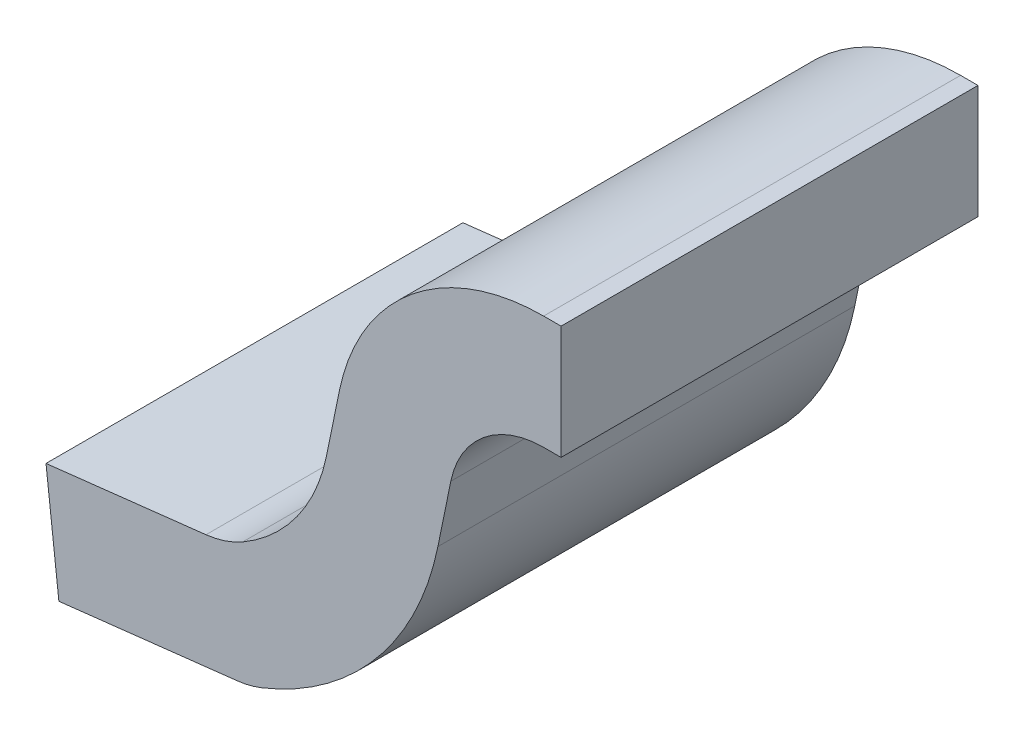
ISO-10303-21;
HEADER;
FILE_DESCRIPTION(('STEP AP214'),'2;1');
FILE_NAME('part.step','',(''),(''),'','','');
FILE_SCHEMA(('AUTOMOTIVE_DESIGN { 1 0 10303 214 1 1 1 1 }'));
ENDSEC;
DATA;
#1=APPLICATION_CONTEXT('core data for automotive mechanical design processes');
#2=APPLICATION_PROTOCOL_DEFINITION('international standard','automotive_design',2000,#1);
#3=PRODUCT_CONTEXT('',#1,'mechanical');
#4=PRODUCT('Part','Part','',(#3));
#5=PRODUCT_RELATED_PRODUCT_CATEGORY('part','',(#4));
#6=PRODUCT_DEFINITION_FORMATION('','',#4);
#7=PRODUCT_DEFINITION_CONTEXT('part definition',#1,'design');
#8=PRODUCT_DEFINITION('design','',#6,#7);
#9=PRODUCT_DEFINITION_SHAPE('','',#8);
#10=(LENGTH_UNIT() NAMED_UNIT(*) SI_UNIT(.MILLI.,.METRE.));
#11=(NAMED_UNIT(*) PLANE_ANGLE_UNIT() SI_UNIT($,.RADIAN.));
#12=(NAMED_UNIT(*) SI_UNIT($,.STERADIAN.) SOLID_ANGLE_UNIT());
#13=UNCERTAINTY_MEASURE_WITH_UNIT(LENGTH_MEASURE(1.E-05),#10,'distance_accuracy_value','');
#14=(GEOMETRIC_REPRESENTATION_CONTEXT(3) GLOBAL_UNCERTAINTY_ASSIGNED_CONTEXT((#13)) GLOBAL_UNIT_ASSIGNED_CONTEXT((#10,
#11,#12)) REPRESENTATION_CONTEXT('',''));
#15=CARTESIAN_POINT('',(0.,0.,0.));
#16=DIRECTION('',(0.,0.,1.));
#17=DIRECTION('',(1.,0.,0.));
#18=AXIS2_PLACEMENT_3D('',#15,#16,#17);
#19=CARTESIAN_POINT('',(-1.0784798395513,0.311122151443951,3.64984430510635));
#20=DIRECTION('',(0.,0.,-1.));
#21=DIRECTION('',(-1.,0.,0.));
#22=AXIS2_PLACEMENT_3D('',#19,#20,#21);
#23=CYLINDRICAL_SURFACE('',#22,0.304673812487565);
#24=CARTESIAN_POINT('',(-1.0784798395513,0.311122151443951,1.23));
#25=DIRECTION('',(0.,0.,1.));
#26=DIRECTION('',(-1.,0.,0.));
#27=AXIS2_PLACEMENT_3D('',#24,#25,#26);
#28=CIRCLE('',#27,0.304673812487565);
#29=CARTESIAN_POINT('',(-0.966363747755729,0.027827050928262,1.23));
#30=VERTEX_POINT('',#29);
#31=CARTESIAN_POINT('',(-0.78,0.25,1.23));
#32=VERTEX_POINT('',#31);
#33=EDGE_CURVE('E11',#30,#32,#28,.T.);
#34=ORIENTED_EDGE('',*,*,#33,.T.);
#35=DIRECTION('',(0.,0.,1.));
#36=VECTOR('',#35,1.);
#37=CARTESIAN_POINT('',(-0.78,0.25,3.64984430510635));
#38=LINE('',#37,#36);
#39=CARTESIAN_POINT('',(-0.78,0.25,1.67));
#40=VERTEX_POINT('',#39);
#41=EDGE_CURVE('E26',#32,#40,#38,.T.);
#42=ORIENTED_EDGE('',*,*,#41,.T.);
#43=CARTESIAN_POINT('',(-1.0784798395513,0.311122151443951,1.67));
#44=DIRECTION('',(0.,0.,-1.));
#45=DIRECTION('',(-1.,0.,0.));
#46=AXIS2_PLACEMENT_3D('',#43,#44,#45);
#47=CIRCLE('',#46,0.304673812487565);
#48=CARTESIAN_POINT('',(-0.966363747755729,0.027827050928262,1.67));
#49=VERTEX_POINT('',#48);
#50=EDGE_CURVE('E246',#40,#49,#47,.T.);
#51=ORIENTED_EDGE('',*,*,#50,.T.);
#52=DIRECTION('',(0.,0.,-1.));
#53=VECTOR('',#52,1.);
#54=CARTESIAN_POINT('',(-0.966363747755728,0.0278270509282621,3.64984430510635));
#55=LINE('',#54,#53);
#56=EDGE_CURVE('E243',#49,#30,#55,.T.);
#57=ORIENTED_EDGE('',*,*,#56,.T.);
#58=EDGE_LOOP('',(#34,#42,#51,#57));
#59=FACE_BOUND('',#58,.T.);
#60=ADVANCED_FACE('F16',(#59),#23,.T.);
#61=CARTESIAN_POINT('',(-0.766369657725016,0.316561504776176,3.64984430510635));
#62=DIRECTION('',(-0.979670149903295,0.200615047761767,0.));
#63=DIRECTION('',(0.143305470647058,0.699808381659803,0.699808381659803));
#64=AXIS2_PLACEMENT_3D('',#61,#62,#63);
#65=PLANE('',#64);
#66=ORIENTED_EDGE('',*,*,#41,.F.);
#67=DIRECTION('',(-0.200615047761767,-0.979670149903295,0.));
#68=VECTOR('',#67,1.);
#69=CARTESIAN_POINT('',(-0.766369657725016,0.316561504776176,1.23));
#70=LINE('',#69,#68);
#71=CARTESIAN_POINT('',(-0.766369657725015,0.316561504776176,1.23));
#72=VERTEX_POINT('',#71);
#73=EDGE_CURVE('E183',#72,#32,#70,.T.);
#74=ORIENTED_EDGE('',*,*,#73,.F.);
#75=DIRECTION('',(0.,0.,-1.));
#76=VECTOR('',#75,1.);
#77=CARTESIAN_POINT('',(-0.766369657725016,0.316561504776176,3.64984430510635));
#78=LINE('',#77,#76);
#79=CARTESIAN_POINT('',(-0.766369657725015,0.316561504776176,1.67));
#80=VERTEX_POINT('',#79);
#81=EDGE_CURVE('E218',#80,#72,#78,.T.);
#82=ORIENTED_EDGE('',*,*,#81,.F.);
#83=DIRECTION('',(0.200615047761767,0.979670149903295,0.));
#84=VECTOR('',#83,1.);
#85=CARTESIAN_POINT('',(-0.766369657725016,0.316561504776176,1.67));
#86=LINE('',#85,#84);
#87=EDGE_CURVE('E128',#40,#80,#86,.T.);
#88=ORIENTED_EDGE('',*,*,#87,.F.);
#89=EDGE_LOOP('',(#66,#74,#82,#88));
#90=FACE_BOUND('',#89,.T.);
#91=ADVANCED_FACE('F251',(#90),#65,.F.);
#92=CARTESIAN_POINT('',(-2.74150408033977,0.,1.23));
#93=DIRECTION('',(0.,0.,-1.));
#94=DIRECTION('',(0.707106781186548,0.707106781186548,0.));
#95=AXIS2_PLACEMENT_3D('',#92,#93,#94);
#96=PLANE('',#95);
#97=DIRECTION('',(0.200615047761764,0.979670149903295,0.));
#98=VECTOR('',#97,1.);
#99=CARTESIAN_POINT('',(-0.897560417988396,0.274073805731411,1.23));
#100=LINE('',#99,#98);
#101=CARTESIAN_POINT('',(-0.897560417988396,0.274073805731411,1.23));
#102=VERTEX_POINT('',#101);
#103=CARTESIAN_POINT('',(-0.883930075713411,0.340635310507587,1.23));
#104=VERTEX_POINT('',#103);
#105=EDGE_CURVE('E175',#102,#104,#100,.T.);
#106=ORIENTED_EDGE('',*,*,#105,.T.);
#107=CARTESIAN_POINT('',(-0.668402642734686,0.2965,1.23));
#108=DIRECTION('',(0.,0.,-1.));
#109=DIRECTION('',(-1.,0.,0.));
#110=AXIS2_PLACEMENT_3D('',#107,#108,#109);
#111=CIRCLE('',#110,0.22);
#112=CARTESIAN_POINT('',(-0.668402642734686,0.5165,1.23));
#113=VERTEX_POINT('',#112);
#114=EDGE_CURVE('E172',#104,#113,#111,.T.);
#115=ORIENTED_EDGE('',*,*,#114,.T.);
#116=DIRECTION('',(1.,0.,0.));
#117=VECTOR('',#116,1.);
#118=CARTESIAN_POINT('',(-2.74150408033977,0.5165,1.23));
#119=LINE('',#118,#117);
#120=CARTESIAN_POINT('',(-0.65,0.5165,1.23));
#121=VERTEX_POINT('',#120);
#122=EDGE_CURVE('E157',#113,#121,#119,.T.);
#123=ORIENTED_EDGE('',*,*,#122,.T.);
#124=DIRECTION('',(0.,-1.,0.));
#125=VECTOR('',#124,1.);
#126=CARTESIAN_POINT('',(-0.65,0.,1.23));
#127=LINE('',#126,#125);
#128=CARTESIAN_POINT('',(-0.65,0.3965,1.23));
#129=VERTEX_POINT('',#128);
#130=EDGE_CURVE('E165',#121,#129,#127,.T.);
#131=ORIENTED_EDGE('',*,*,#130,.T.);
#132=DIRECTION('',(-1.,0.,0.));
#133=VECTOR('',#132,1.);
#134=CARTESIAN_POINT('',(-2.74150408033977,0.3965,1.23));
#135=LINE('',#134,#133);
#136=CARTESIAN_POINT('',(-0.668402642734686,0.3965,1.23));
#137=VERTEX_POINT('',#136);
#138=EDGE_CURVE('E168',#129,#137,#135,.T.);
#139=ORIENTED_EDGE('',*,*,#138,.T.);
#140=CARTESIAN_POINT('',(-0.668402642734686,0.2965,1.23));
#141=DIRECTION('',(0.,0.,1.));
#142=DIRECTION('',(-1.,0.,0.));
#143=AXIS2_PLACEMENT_3D('',#140,#141,#142);
#144=CIRCLE('',#143,0.1);
#145=EDGE_CURVE('E180',#137,#72,#144,.T.);
#146=ORIENTED_EDGE('',*,*,#145,.T.);
#147=ORIENTED_EDGE('',*,*,#73,.T.);
#148=ORIENTED_EDGE('',*,*,#33,.F.);
#149=CARTESIAN_POINT('',(-1.00316247715101,0.120810132802833,1.23));
#150=DIRECTION('',(0.,0.,-1.));
#151=DIRECTION('',(-1.,0.,0.));
#152=AXIS2_PLACEMENT_3D('',#149,#150,#151);
#153=CIRCLE('',#152,0.1);
#154=CARTESIAN_POINT('',(-0.991834300901524,0.0214538424993968,1.23));
#155=VERTEX_POINT('',#154);
#156=EDGE_CURVE('E184',#30,#155,#153,.T.);
#157=ORIENTED_EDGE('',*,*,#156,.T.);
#158=DIRECTION('',(-0.993562903034362,-0.113281762494813,0.));
#159=VECTOR('',#158,1.);
#160=CARTESIAN_POINT('',(-0.991834300901524,0.0214538424993968,1.23));
#161=LINE('',#160,#159);
#162=CARTESIAN_POINT('',(-1.18,0.,1.23));
#163=VERTEX_POINT('',#162);
#164=EDGE_CURVE('E187',#155,#163,#161,.T.);
#165=ORIENTED_EDGE('',*,*,#164,.T.);
#166=DIRECTION('',(-0.113281762494815,0.993562903034362,0.));
#167=VECTOR('',#166,1.);
#168=CARTESIAN_POINT('',(-1.18,0.,1.23));
#169=LINE('',#168,#167);
#170=CARTESIAN_POINT('',(-1.19359381149938,0.119227548364122,1.23));
#171=VERTEX_POINT('',#170);
#172=EDGE_CURVE('E138',#163,#171,#169,.T.);
#173=ORIENTED_EDGE('',*,*,#172,.T.);
#174=DIRECTION('',(0.993562903034362,0.113281762494813,0.));
#175=VECTOR('',#174,1.);
#176=CARTESIAN_POINT('',(-1.19359381149938,0.119227548364122,1.23));
#177=LINE('',#176,#175);
#178=CARTESIAN_POINT('',(-1.02473971532561,0.13847956508155,1.23));
#179=VERTEX_POINT('',#178);
#180=EDGE_CURVE('E190',#171,#179,#177,.T.);
#181=ORIENTED_EDGE('',*,*,#180,.T.);
#182=CARTESIAN_POINT('',(-1.03606789157509,0.237835855384986,1.23));
#183=DIRECTION('',(0.,0.,1.));
#184=DIRECTION('',(-1.,0.,0.));
#185=AXIS2_PLACEMENT_3D('',#182,#183,#184);
#186=CIRCLE('',#185,0.1);
#187=CARTESIAN_POINT('',(-0.985979267087511,0.151284542876496,1.23));
#188=VERTEX_POINT('',#187);
#189=EDGE_CURVE('E193',#179,#188,#186,.T.);
#190=ORIENTED_EDGE('',*,*,#189,.T.);
#191=CARTESIAN_POINT('',(-1.0784798395513,0.311122151443951,1.23));
#192=DIRECTION('',(0.,0.,1.));
#193=DIRECTION('',(-1.,0.,0.));
#194=AXIS2_PLACEMENT_3D('',#191,#192,#193);
#195=CIRCLE('',#194,0.184673812487564);
#196=EDGE_CURVE('E196',#188,#102,#195,.T.);
#197=ORIENTED_EDGE('',*,*,#196,.T.);
#198=EDGE_LOOP('',(#106,#115,#123,#131,#139,#146,#147,#148,#157,#165,#173,#181,#190,#197));
#199=FACE_BOUND('',#198,.T.);
#200=ADVANCED_FACE('F171',(#199),#96,.T.);
#201=CARTESIAN_POINT('',(-1.00316247715101,0.120810132802833,3.64984430510635));
#202=DIRECTION('',(0.,0.,-1.));
#203=DIRECTION('',(-1.,0.,0.));
#204=AXIS2_PLACEMENT_3D('',#201,#202,#203);
#205=CYLINDRICAL_SURFACE('',#204,0.1);
#206=ORIENTED_EDGE('',*,*,#156,.F.);
#207=ORIENTED_EDGE('',*,*,#56,.F.);
#208=CARTESIAN_POINT('',(-1.00316247715101,0.120810132802833,1.67));
#209=DIRECTION('',(0.,0.,-1.));
#210=DIRECTION('',(-1.,0.,0.));
#211=AXIS2_PLACEMENT_3D('',#208,#209,#210);
#212=CIRCLE('',#211,0.1);
#213=CARTESIAN_POINT('',(-0.991834300901524,0.0214538424993968,1.67));
#214=VERTEX_POINT('',#213);
#215=EDGE_CURVE('E198',#49,#214,#212,.T.);
#216=ORIENTED_EDGE('',*,*,#215,.T.);
#217=DIRECTION('',(0.,0.,-1.));
#218=VECTOR('',#217,1.);
#219=CARTESIAN_POINT('',(-0.991834300901524,0.0214538424993968,3.64984430510635));
#220=LINE('',#219,#218);
#221=EDGE_CURVE('E124',#214,#155,#220,.T.);
#222=ORIENTED_EDGE('',*,*,#221,.T.);
#223=EDGE_LOOP('',(#206,#207,#216,#222));
#224=FACE_BOUND('',#223,.T.);
#225=ADVANCED_FACE('F241',(#224),#205,.T.);
#226=CARTESIAN_POINT('',(-2.74150408033977,0.,1.67));
#227=DIRECTION('',(0.,0.,1.));
#228=DIRECTION('',(0.707106781186548,0.707106781186548,0.));
#229=AXIS2_PLACEMENT_3D('',#226,#227,#228);
#230=PLANE('',#229);
#231=DIRECTION('',(1.,0.,0.));
#232=VECTOR('',#231,1.);
#233=CARTESIAN_POINT('',(-2.74150408033977,0.3965,1.67));
#234=LINE('',#233,#232);
#235=CARTESIAN_POINT('',(-0.668402642734686,0.3965,1.67));
#236=VERTEX_POINT('',#235);
#237=CARTESIAN_POINT('',(-0.65,0.3965,1.67));
#238=VERTEX_POINT('',#237);
#239=EDGE_CURVE('E201',#236,#238,#234,.T.);
#240=ORIENTED_EDGE('',*,*,#239,.T.);
#241=DIRECTION('',(0.,1.,0.));
#242=VECTOR('',#241,1.);
#243=CARTESIAN_POINT('',(-0.65,0.,1.67));
#244=LINE('',#243,#242);
#245=CARTESIAN_POINT('',(-0.65,0.5165,1.67));
#246=VERTEX_POINT('',#245);
#247=EDGE_CURVE('E163',#238,#246,#244,.T.);
#248=ORIENTED_EDGE('',*,*,#247,.T.);
#249=DIRECTION('',(-1.,0.,0.));
#250=VECTOR('',#249,1.);
#251=CARTESIAN_POINT('',(-2.74150408033977,0.5165,1.67));
#252=LINE('',#251,#250);
#253=CARTESIAN_POINT('',(-0.668402642734686,0.5165,1.67));
#254=VERTEX_POINT('',#253);
#255=EDGE_CURVE('E160',#246,#254,#252,.T.);
#256=ORIENTED_EDGE('',*,*,#255,.T.);
#257=CARTESIAN_POINT('',(-0.668402642734686,0.2965,1.67));
#258=DIRECTION('',(0.,0.,1.));
#259=DIRECTION('',(-1.,0.,0.));
#260=AXIS2_PLACEMENT_3D('',#257,#258,#259);
#261=CIRCLE('',#260,0.22);
#262=CARTESIAN_POINT('',(-0.883930075713411,0.340635310507587,1.67));
#263=VERTEX_POINT('',#262);
#264=EDGE_CURVE('E205',#254,#263,#261,.T.);
#265=ORIENTED_EDGE('',*,*,#264,.T.);
#266=DIRECTION('',(-0.200615047761764,-0.979670149903295,0.));
#267=VECTOR('',#266,1.);
#268=CARTESIAN_POINT('',(-0.883930075713411,0.340635310507586,1.67));
#269=LINE('',#268,#267);
#270=CARTESIAN_POINT('',(-0.897560417988396,0.274073805731411,1.67));
#271=VERTEX_POINT('',#270);
#272=EDGE_CURVE('E208',#263,#271,#269,.T.);
#273=ORIENTED_EDGE('',*,*,#272,.T.);
#274=CARTESIAN_POINT('',(-1.0784798395513,0.311122151443951,1.67));
#275=DIRECTION('',(0.,0.,-1.));
#276=DIRECTION('',(-1.,0.,0.));
#277=AXIS2_PLACEMENT_3D('',#274,#275,#276);
#278=CIRCLE('',#277,0.184673812487564);
#279=CARTESIAN_POINT('',(-0.985979267087511,0.151284542876496,1.67));
#280=VERTEX_POINT('',#279);
#281=EDGE_CURVE('E211',#271,#280,#278,.T.);
#282=ORIENTED_EDGE('',*,*,#281,.T.);
#283=CARTESIAN_POINT('',(-1.03606789157509,0.237835855384986,1.67));
#284=DIRECTION('',(0.,0.,-1.));
#285=DIRECTION('',(-1.,0.,0.));
#286=AXIS2_PLACEMENT_3D('',#283,#284,#285);
#287=CIRCLE('',#286,0.1);
#288=CARTESIAN_POINT('',(-1.02473971532561,0.13847956508155,1.67));
#289=VERTEX_POINT('',#288);
#290=EDGE_CURVE('E214',#280,#289,#287,.T.);
#291=ORIENTED_EDGE('',*,*,#290,.T.);
#292=DIRECTION('',(-0.993562903034362,-0.113281762494813,0.));
#293=VECTOR('',#292,1.);
#294=CARTESIAN_POINT('',(-1.02473971532561,0.13847956508155,1.67));
#295=LINE('',#294,#293);
#296=CARTESIAN_POINT('',(-1.19359381149938,0.119227548364122,1.67));
#297=VERTEX_POINT('',#296);
#298=EDGE_CURVE('E133',#289,#297,#295,.T.);
#299=ORIENTED_EDGE('',*,*,#298,.T.);
#300=DIRECTION('',(0.113281762494811,-0.993562903034362,0.));
#301=VECTOR('',#300,1.);
#302=CARTESIAN_POINT('',(-1.19359381149938,0.119227548364122,1.67));
#303=LINE('',#302,#301);
#304=CARTESIAN_POINT('',(-1.18,0.,1.67));
#305=VERTEX_POINT('',#304);
#306=EDGE_CURVE('E114',#297,#305,#303,.T.);
#307=ORIENTED_EDGE('',*,*,#306,.T.);
#308=DIRECTION('',(0.993562903034362,0.113281762494813,0.));
#309=VECTOR('',#308,1.);
#310=CARTESIAN_POINT('',(-1.18,0.,1.67));
#311=LINE('',#310,#309);
#312=EDGE_CURVE('E120',#305,#214,#311,.T.);
#313=ORIENTED_EDGE('',*,*,#312,.T.);
#314=ORIENTED_EDGE('',*,*,#215,.F.);
#315=ORIENTED_EDGE('',*,*,#50,.F.);
#316=ORIENTED_EDGE('',*,*,#87,.T.);
#317=CARTESIAN_POINT('',(-0.668402642734686,0.2965,1.67));
#318=DIRECTION('',(0.,0.,-1.));
#319=DIRECTION('',(-1.,0.,0.));
#320=AXIS2_PLACEMENT_3D('',#317,#318,#319);
#321=CIRCLE('',#320,0.1);
#322=EDGE_CURVE('E217',#80,#236,#321,.T.);
#323=ORIENTED_EDGE('',*,*,#322,.T.);
#324=EDGE_LOOP('',(#240,#248,#256,#265,#273,#282,#291,#299,#307,#313,#314,#315,#316,#323));
#325=FACE_BOUND('',#324,.T.);
#326=ADVANCED_FACE('F131',(#325),#230,.T.);
#327=CARTESIAN_POINT('',(-0.668402642734686,0.2965,3.64984430510635));
#328=DIRECTION('',(0.,0.,-1.));
#329=DIRECTION('',(-1.,0.,0.));
#330=AXIS2_PLACEMENT_3D('',#327,#328,#329);
#331=CYLINDRICAL_SURFACE('',#330,0.1);
#332=ORIENTED_EDGE('',*,*,#81,.T.);
#333=ORIENTED_EDGE('',*,*,#145,.F.);
#334=DIRECTION('',(0.,0.,-1.));
#335=VECTOR('',#334,1.);
#336=CARTESIAN_POINT('',(-0.668402642734686,0.3965,3.64984430510635));
#337=LINE('',#336,#335);
#338=EDGE_CURVE('E141',#236,#137,#337,.T.);
#339=ORIENTED_EDGE('',*,*,#338,.F.);
#340=ORIENTED_EDGE('',*,*,#322,.F.);
#341=EDGE_LOOP('',(#332,#333,#339,#340));
#342=FACE_BOUND('',#341,.T.);
#343=ADVANCED_FACE('F260',(#342),#331,.F.);
#344=CARTESIAN_POINT('',(-0.668402642734686,0.2965,3.64984430510635));
#345=DIRECTION('',(0.,0.,-1.));
#346=DIRECTION('',(-1.,0.,0.));
#347=AXIS2_PLACEMENT_3D('',#344,#345,#346);
#348=CYLINDRICAL_SURFACE('',#347,0.22);
#349=ORIENTED_EDGE('',*,*,#114,.F.);
#350=DIRECTION('',(0.,0.,1.));
#351=VECTOR('',#350,1.);
#352=CARTESIAN_POINT('',(-0.883930075713411,0.340635310507586,3.64984430510635));
#353=LINE('',#352,#351);
#354=EDGE_CURVE('E220',#104,#263,#353,.T.);
#355=ORIENTED_EDGE('',*,*,#354,.T.);
#356=ORIENTED_EDGE('',*,*,#264,.F.);
#357=DIRECTION('',(0.,0.,-1.));
#358=VECTOR('',#357,1.);
#359=CARTESIAN_POINT('',(-0.668402642734686,0.5165,3.64984430510635));
#360=LINE('',#359,#358);
#361=EDGE_CURVE('E223',#254,#113,#360,.T.);
#362=ORIENTED_EDGE('',*,*,#361,.T.);
#363=EDGE_LOOP('',(#349,#355,#356,#362));
#364=FACE_BOUND('',#363,.T.);
#365=ADVANCED_FACE('F287',(#364),#348,.T.);
#366=CARTESIAN_POINT('',(-0.883930075713411,0.340635310507586,3.64984430510635));
#367=DIRECTION('',(0.979670149903295,-0.200615047761764,0.));
#368=DIRECTION('',(0.143305470647057,0.699808381659803,0.699808381659803));
#369=AXIS2_PLACEMENT_3D('',#366,#367,#368);
#370=PLANE('',#369);
#371=ORIENTED_EDGE('',*,*,#354,.F.);
#372=ORIENTED_EDGE('',*,*,#105,.F.);
#373=DIRECTION('',(0.,0.,-1.));
#374=VECTOR('',#373,1.);
#375=CARTESIAN_POINT('',(-0.897560417988396,0.274073805731411,3.64984430510635));
#376=LINE('',#375,#374);
#377=EDGE_CURVE('E225',#271,#102,#376,.T.);
#378=ORIENTED_EDGE('',*,*,#377,.F.);
#379=ORIENTED_EDGE('',*,*,#272,.F.);
#380=EDGE_LOOP('',(#371,#372,#378,#379));
#381=FACE_BOUND('',#380,.T.);
#382=ADVANCED_FACE('F290',(#381),#370,.F.);
#383=CARTESIAN_POINT('',(-1.0784798395513,0.311122151443951,3.64984430510635));
#384=DIRECTION('',(0.,0.,-1.));
#385=DIRECTION('',(-1.,0.,0.));
#386=AXIS2_PLACEMENT_3D('',#383,#384,#385);
#387=CYLINDRICAL_SURFACE('',#386,0.184673812487564);
#388=ORIENTED_EDGE('',*,*,#377,.T.);
#389=ORIENTED_EDGE('',*,*,#196,.F.);
#390=DIRECTION('',(0.,0.,-1.));
#391=VECTOR('',#390,1.);
#392=CARTESIAN_POINT('',(-0.985979267087511,0.151284542876496,3.64984430510635));
#393=LINE('',#392,#391);
#394=EDGE_CURVE('E228',#280,#188,#393,.T.);
#395=ORIENTED_EDGE('',*,*,#394,.F.);
#396=ORIENTED_EDGE('',*,*,#281,.F.);
#397=EDGE_LOOP('',(#388,#389,#395,#396));
#398=FACE_BOUND('',#397,.T.);
#399=ADVANCED_FACE('F294',(#398),#387,.F.);
#400=CARTESIAN_POINT('',(-1.03606789157509,0.237835855384986,3.64984430510635));
#401=DIRECTION('',(0.,0.,-1.));
#402=DIRECTION('',(-1.,0.,0.));
#403=AXIS2_PLACEMENT_3D('',#400,#401,#402);
#404=CYLINDRICAL_SURFACE('',#403,0.1);
#405=ORIENTED_EDGE('',*,*,#394,.T.);
#406=ORIENTED_EDGE('',*,*,#189,.F.);
#407=DIRECTION('',(0.,0.,-1.));
#408=VECTOR('',#407,1.);
#409=CARTESIAN_POINT('',(-1.02473971532561,0.13847956508155,3.64984430510635));
#410=LINE('',#409,#408);
#411=EDGE_CURVE('E143',#289,#179,#410,.T.);
#412=ORIENTED_EDGE('',*,*,#411,.F.);
#413=ORIENTED_EDGE('',*,*,#290,.F.);
#414=EDGE_LOOP('',(#405,#406,#412,#413));
#415=FACE_BOUND('',#414,.T.);
#416=ADVANCED_FACE('F235',(#415),#404,.F.);
#417=CARTESIAN_POINT('',(-1.19359381149938,0.119227548364122,3.64984430510635));
#418=DIRECTION('',(0.113281762494814,-0.993562903034362,0.));
#419=DIRECTION('',(0.704819900881673,0.0803605291315253,0.704819900881673));
#420=AXIS2_PLACEMENT_3D('',#417,#418,#419);
#421=PLANE('',#420);
#422=ORIENTED_EDGE('',*,*,#411,.T.);
#423=ORIENTED_EDGE('',*,*,#180,.F.);
#424=DIRECTION('',(0.,0.,-1.));
#425=VECTOR('',#424,1.);
#426=CARTESIAN_POINT('',(-1.19359381149938,0.119227548364122,3.64984430510635));
#427=LINE('',#426,#425);
#428=EDGE_CURVE('E140',#297,#171,#427,.T.);
#429=ORIENTED_EDGE('',*,*,#428,.F.);
#430=ORIENTED_EDGE('',*,*,#298,.F.);
#431=EDGE_LOOP('',(#422,#423,#429,#430));
#432=FACE_BOUND('',#431,.T.);
#433=ADVANCED_FACE('F233',(#432),#421,.F.);
#434=CARTESIAN_POINT('',(-1.19359381149938,0.119227548364122,3.64984430510635));
#435=DIRECTION('',(0.993562903034361,0.11328176249482,0.));
#436=DIRECTION('',(-0.0803605291315301,0.704819900881672,0.704819900881672));
#437=AXIS2_PLACEMENT_3D('',#434,#435,#436);
#438=PLANE('',#437);
#439=ORIENTED_EDGE('',*,*,#428,.T.);
#440=ORIENTED_EDGE('',*,*,#172,.F.);
#441=DIRECTION('',(0.,0.,-1.));
#442=VECTOR('',#441,1.);
#443=CARTESIAN_POINT('',(-1.18,0.,3.64984430510635));
#444=LINE('',#443,#442);
#445=EDGE_CURVE('E122',#305,#163,#444,.T.);
#446=ORIENTED_EDGE('',*,*,#445,.F.);
#447=ORIENTED_EDGE('',*,*,#306,.F.);
#448=EDGE_LOOP('',(#439,#440,#446,#447));
#449=FACE_BOUND('',#448,.T.);
#450=ADVANCED_FACE('F136',(#449),#438,.F.);
#451=CARTESIAN_POINT('',(-1.18,0.,3.64984430510635));
#452=DIRECTION('',(-0.113281762494813,0.993562903034362,0.));
#453=DIRECTION('',(0.704819900881673,0.0803605291315249,0.704819900881673));
#454=AXIS2_PLACEMENT_3D('',#451,#452,#453);
#455=PLANE('',#454);
#456=ORIENTED_EDGE('',*,*,#445,.T.);
#457=ORIENTED_EDGE('',*,*,#164,.F.);
#458=ORIENTED_EDGE('',*,*,#221,.F.);
#459=ORIENTED_EDGE('',*,*,#312,.F.);
#460=EDGE_LOOP('',(#456,#457,#458,#459));
#461=FACE_BOUND('',#460,.T.);
#462=ADVANCED_FACE('F121',(#461),#455,.F.);
#463=CARTESIAN_POINT('',(-0.65,0.3965,3.64984430510635));
#464=DIRECTION('',(0.,1.,0.));
#465=DIRECTION('',(0.707106781186548,0.,0.707106781186548));
#466=AXIS2_PLACEMENT_3D('',#463,#464,#465);
#467=PLANE('',#466);
#468=ORIENTED_EDGE('',*,*,#338,.T.);
#469=ORIENTED_EDGE('',*,*,#138,.F.);
#470=DIRECTION('',(0.,0.,-1.));
#471=VECTOR('',#470,1.);
#472=CARTESIAN_POINT('',(-0.65,0.3965,3.64984430510635));
#473=LINE('',#472,#471);
#474=EDGE_CURVE('E146',#238,#129,#473,.T.);
#475=ORIENTED_EDGE('',*,*,#474,.F.);
#476=ORIENTED_EDGE('',*,*,#239,.F.);
#477=EDGE_LOOP('',(#468,#469,#475,#476));
#478=FACE_BOUND('',#477,.T.);
#479=ADVANCED_FACE('F263',(#478),#467,.F.);
#480=CARTESIAN_POINT('',(-0.65,0.5165,3.64984430510635));
#481=DIRECTION('',(-1.,0.,0.));
#482=DIRECTION('',(0.,0.707106781186548,0.707106781186548));
#483=AXIS2_PLACEMENT_3D('',#480,#481,#482);
#484=PLANE('',#483);
#485=ORIENTED_EDGE('',*,*,#474,.T.);
#486=ORIENTED_EDGE('',*,*,#130,.F.);
#487=DIRECTION('',(0.,0.,-1.));
#488=VECTOR('',#487,1.);
#489=CARTESIAN_POINT('',(-0.65,0.5165,3.64984430510635));
#490=LINE('',#489,#488);
#491=EDGE_CURVE('E20',#246,#121,#490,.T.);
#492=ORIENTED_EDGE('',*,*,#491,.F.);
#493=ORIENTED_EDGE('',*,*,#247,.F.);
#494=EDGE_LOOP('',(#485,#486,#492,#493));
#495=FACE_BOUND('',#494,.T.);
#496=ADVANCED_FACE('F162',(#495),#484,.F.);
#497=CARTESIAN_POINT('',(-0.65,0.5165,3.64984430510635));
#498=DIRECTION('',(0.,-1.,0.));
#499=DIRECTION('',(0.707106781186548,0.,0.707106781186548));
#500=AXIS2_PLACEMENT_3D('',#497,#498,#499);
#501=PLANE('',#500);
#502=ORIENTED_EDGE('',*,*,#491,.T.);
#503=ORIENTED_EDGE('',*,*,#122,.F.);
#504=ORIENTED_EDGE('',*,*,#361,.F.);
#505=ORIENTED_EDGE('',*,*,#255,.F.);
#506=EDGE_LOOP('',(#502,#503,#504,#505));
#507=FACE_BOUND('',#506,.T.);
#508=ADVANCED_FACE('F18',(#507),#501,.F.);
#509=CLOSED_SHELL('',(#60,#91,#200,#225,#326,#343,#365,#382,#399,#416,#433,#450,#462,#479,#496,#508));
#510=MANIFOLD_SOLID_BREP('B1',#509);
#511=ADVANCED_BREP_SHAPE_REPRESENTATION('',(#18,#510),#14);
#512=SHAPE_DEFINITION_REPRESENTATION(#9,#511);
ENDSEC;
END-ISO-10303-21;
